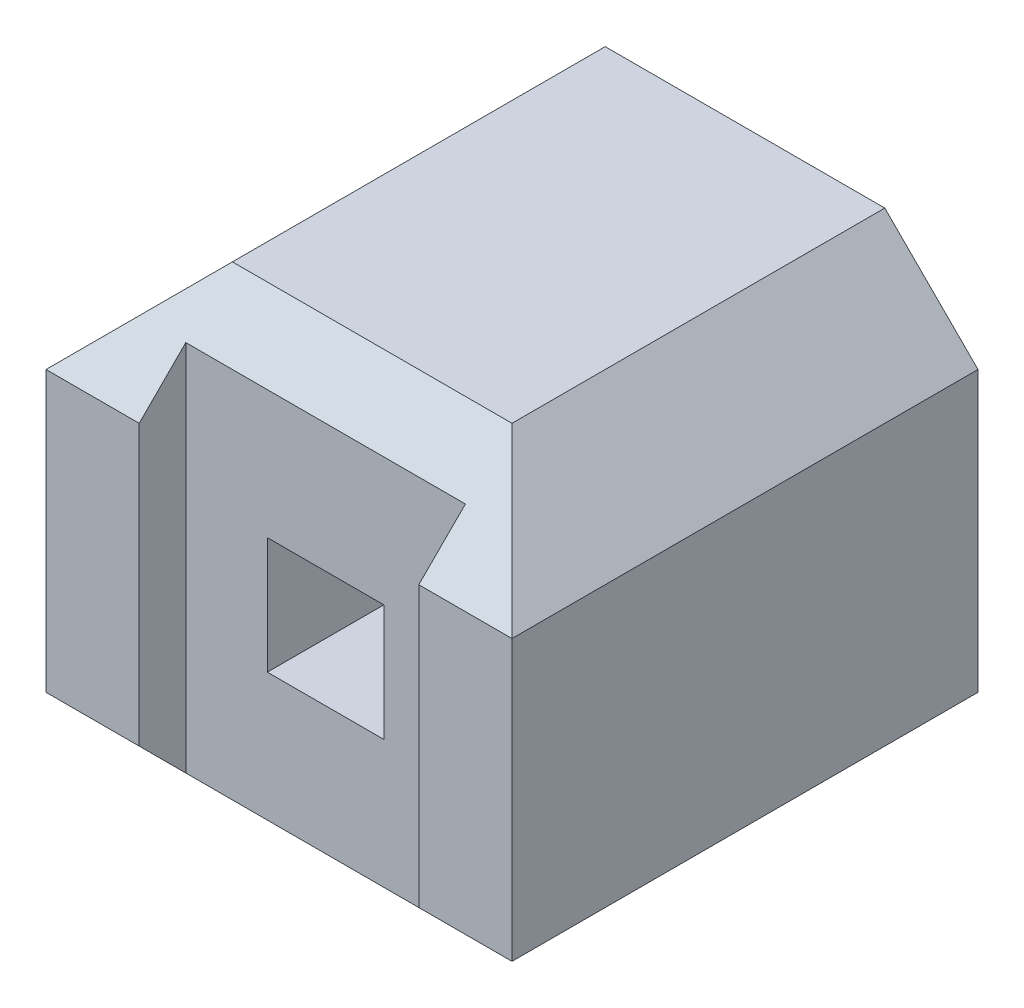
ISO-10303-21;
HEADER;
FILE_DESCRIPTION(('STEP AP214'),'2;1');
FILE_NAME('part.step','',(''),(''),'','','');
FILE_SCHEMA(('AUTOMOTIVE_DESIGN { 1 0 10303 214 1 1 1 1 }'));
ENDSEC;
DATA;
#1=APPLICATION_CONTEXT('core data for automotive mechanical design processes');
#2=APPLICATION_PROTOCOL_DEFINITION('international standard','automotive_design',2000,#1);
#3=PRODUCT_CONTEXT('',#1,'mechanical');
#4=PRODUCT('Part','Part','',(#3));
#5=PRODUCT_RELATED_PRODUCT_CATEGORY('part','',(#4));
#6=PRODUCT_DEFINITION_FORMATION('','',#4);
#7=PRODUCT_DEFINITION_CONTEXT('part definition',#1,'design');
#8=PRODUCT_DEFINITION('design','',#6,#7);
#9=PRODUCT_DEFINITION_SHAPE('','',#8);
#10=(LENGTH_UNIT() NAMED_UNIT(*) SI_UNIT(.MILLI.,.METRE.));
#11=(NAMED_UNIT(*) PLANE_ANGLE_UNIT() SI_UNIT($,.RADIAN.));
#12=(NAMED_UNIT(*) SI_UNIT($,.STERADIAN.) SOLID_ANGLE_UNIT());
#13=UNCERTAINTY_MEASURE_WITH_UNIT(LENGTH_MEASURE(1.E-05),#10,'distance_accuracy_value','');
#14=(GEOMETRIC_REPRESENTATION_CONTEXT(3) GLOBAL_UNCERTAINTY_ASSIGNED_CONTEXT((#13)) GLOBAL_UNIT_ASSIGNED_CONTEXT((#10,
#11,#12)) REPRESENTATION_CONTEXT('',''));
#15=CARTESIAN_POINT('',(0.,0.,0.));
#16=DIRECTION('',(0.,0.,1.));
#17=DIRECTION('',(1.,0.,0.));
#18=AXIS2_PLACEMENT_3D('',#15,#16,#17);
#19=CARTESIAN_POINT('',(1.27,11.43,2.54));
#20=DIRECTION('',(-1.,0.,0.));
#21=DIRECTION('',(0.,0.,1.));
#22=AXIS2_PLACEMENT_3D('',#19,#20,#21);
#23=PLANE('',#22);
#24=DIRECTION('',(0.,0.,1.));
#25=VECTOR('',#24,1.);
#26=CARTESIAN_POINT('',(1.27,13.462,2.54));
#27=LINE('',#26,#25);
#28=CARTESIAN_POINT('',(1.27,13.462,0.));
#29=VERTEX_POINT('',#28);
#30=CARTESIAN_POINT('',(1.27,13.462,2.54));
#31=VERTEX_POINT('',#30);
#32=EDGE_CURVE('E158',#29,#31,#27,.T.);
#33=ORIENTED_EDGE('',*,*,#32,.T.);
#34=DIRECTION('',(0.,1.,0.));
#35=VECTOR('',#34,1.);
#36=CARTESIAN_POINT('',(1.27,0.,2.54));
#37=LINE('',#36,#35);
#38=CARTESIAN_POINT('',(1.27,11.938,2.54));
#39=VERTEX_POINT('',#38);
#40=EDGE_CURVE('E127',#39,#31,#37,.T.);
#41=ORIENTED_EDGE('',*,*,#40,.F.);
#42=DIRECTION('',(0.,0.,1.));
#43=VECTOR('',#42,1.);
#44=CARTESIAN_POINT('',(1.27,11.938,2.54));
#45=LINE('',#44,#43);
#46=CARTESIAN_POINT('',(1.27,11.938,0.));
#47=VERTEX_POINT('',#46);
#48=EDGE_CURVE('E151',#39,#47,#45,.F.);
#49=ORIENTED_EDGE('',*,*,#48,.T.);
#50=DIRECTION('',(0.,1.,0.));
#51=VECTOR('',#50,1.);
#52=CARTESIAN_POINT('',(1.27,11.43,0.));
#53=LINE('',#52,#51);
#54=EDGE_CURVE('E19',#29,#47,#53,.F.);
#55=ORIENTED_EDGE('',*,*,#54,.F.);
#56=EDGE_LOOP('',(#33,#41,#49,#55));
#57=FACE_BOUND('',#56,.T.);
#58=ADVANCED_FACE('F16',(#57),#23,.F.);
#59=CARTESIAN_POINT('',(0.,0.,2.54));
#60=DIRECTION('',(0.,0.,1.));
#61=DIRECTION('',(1.,0.,0.));
#62=AXIS2_PLACEMENT_3D('',#59,#60,#61);
#63=PLANE('',#62);
#64=ORIENTED_EDGE('',*,*,#40,.T.);
#65=DIRECTION('',(1.,0.,0.));
#66=VECTOR('',#65,1.);
#67=CARTESIAN_POINT('',(0.,13.462,2.54));
#68=LINE('',#67,#66);
#69=CARTESIAN_POINT('',(0.762,13.462,2.54));
#70=VERTEX_POINT('',#69);
#71=EDGE_CURVE('E155',#31,#70,#68,.F.);
#72=ORIENTED_EDGE('',*,*,#71,.T.);
#73=DIRECTION('',(0.,-1.,0.));
#74=VECTOR('',#73,1.);
#75=CARTESIAN_POINT('',(0.762,13.97,2.54));
#76=LINE('',#75,#74);
#77=CARTESIAN_POINT('',(0.762,11.938,2.54));
#78=VERTEX_POINT('',#77);
#79=EDGE_CURVE('E134',#78,#70,#76,.F.);
#80=ORIENTED_EDGE('',*,*,#79,.F.);
#81=DIRECTION('',(1.,0.,0.));
#82=VECTOR('',#81,1.);
#83=CARTESIAN_POINT('',(0.,11.938,2.54));
#84=LINE('',#83,#82);
#85=EDGE_CURVE('E130',#78,#39,#84,.T.);
#86=ORIENTED_EDGE('',*,*,#85,.T.);
#87=EDGE_LOOP('',(#64,#72,#80,#86));
#88=FACE_BOUND('',#87,.T.);
#89=ADVANCED_FACE('F132',(#88),#63,.T.);
#90=CARTESIAN_POINT('',(1.27,11.938,2.54));
#91=DIRECTION('',(-0.707106781186548,0.707106781186548,0.));
#92=DIRECTION('',(-0.707106781186548,-0.707106781186548,0.));
#93=AXIS2_PLACEMENT_3D('',#90,#91,#92);
#94=PLANE('',#93);
#95=ORIENTED_EDGE('',*,*,#48,.F.);
#96=DIRECTION('',(0.577350269189626,0.577350269189625,0.577350269189626));
#97=VECTOR('',#96,1.);
#98=CARTESIAN_POINT('',(0.762,11.43,2.032));
#99=LINE('',#98,#97);
#100=CARTESIAN_POINT('',(0.762,11.43,2.032));
#101=VERTEX_POINT('',#100);
#102=EDGE_CURVE('E138',#101,#39,#99,.T.);
#103=ORIENTED_EDGE('',*,*,#102,.F.);
#104=DIRECTION('',(0.,0.,1.));
#105=VECTOR('',#104,1.);
#106=CARTESIAN_POINT('',(0.762,11.43,2.54));
#107=LINE('',#106,#105);
#108=CARTESIAN_POINT('',(0.761999999999999,11.43,0.));
#109=VERTEX_POINT('',#108);
#110=EDGE_CURVE('E182',#101,#109,#107,.F.);
#111=ORIENTED_EDGE('',*,*,#110,.T.);
#112=DIRECTION('',(-0.707106781186548,-0.707106781186548,0.));
#113=VECTOR('',#112,1.);
#114=CARTESIAN_POINT('',(1.27,11.938,0.));
#115=LINE('',#114,#113);
#116=EDGE_CURVE('E153',#47,#109,#115,.T.);
#117=ORIENTED_EDGE('',*,*,#116,.F.);
#118=EDGE_LOOP('',(#95,#103,#111,#117));
#119=FACE_BOUND('',#118,.T.);
#120=ADVANCED_FACE('F152',(#119),#94,.F.);
#121=CARTESIAN_POINT('',(0.762,13.97,2.54));
#122=DIRECTION('',(-0.707106781186547,-0.707106781186548,0.));
#123=DIRECTION('',(0.707106781186548,-0.707106781186547,0.));
#124=AXIS2_PLACEMENT_3D('',#121,#122,#123);
#125=PLANE('',#124);
#126=DIRECTION('',(0.,0.,-1.));
#127=VECTOR('',#126,1.);
#128=CARTESIAN_POINT('',(0.762,13.97,2.54));
#129=LINE('',#128,#127);
#130=CARTESIAN_POINT('',(0.762,13.97,0.));
#131=VERTEX_POINT('',#130);
#132=CARTESIAN_POINT('',(0.762,13.97,2.032));
#133=VERTEX_POINT('',#132);
#134=EDGE_CURVE('E186',#131,#133,#129,.F.);
#135=ORIENTED_EDGE('',*,*,#134,.T.);
#136=DIRECTION('',(-0.577350269189626,0.577350269189625,-0.577350269189626));
#137=VECTOR('',#136,1.);
#138=CARTESIAN_POINT('',(1.27,13.462,2.54));
#139=LINE('',#138,#137);
#140=EDGE_CURVE('E165',#31,#133,#139,.T.);
#141=ORIENTED_EDGE('',*,*,#140,.F.);
#142=ORIENTED_EDGE('',*,*,#32,.F.);
#143=DIRECTION('',(0.707106781186548,-0.707106781186547,0.));
#144=VECTOR('',#143,1.);
#145=CARTESIAN_POINT('',(0.762,13.97,0.));
#146=LINE('',#145,#144);
#147=EDGE_CURVE('E167',#131,#29,#146,.T.);
#148=ORIENTED_EDGE('',*,*,#147,.F.);
#149=EDGE_LOOP('',(#135,#141,#142,#148));
#150=FACE_BOUND('',#149,.T.);
#151=ADVANCED_FACE('F357',(#150),#125,.F.);
#152=CARTESIAN_POINT('',(0.762,13.97,2.286));
#153=DIRECTION('',(-1.,0.,0.));
#154=DIRECTION('',(0.,-1.,0.));
#155=AXIS2_PLACEMENT_3D('',#152,#153,#154);
#156=PLANE('',#155);
#157=ORIENTED_EDGE('',*,*,#79,.T.);
#158=DIRECTION('',(0.,-0.707106781186547,0.707106781186548));
#159=VECTOR('',#158,1.);
#160=CARTESIAN_POINT('',(0.762,13.462,2.54));
#161=LINE('',#160,#159);
#162=CARTESIAN_POINT('',(0.762,13.716,2.286));
#163=VERTEX_POINT('',#162);
#164=EDGE_CURVE('E196',#163,#70,#161,.T.);
#165=ORIENTED_EDGE('',*,*,#164,.F.);
#166=DIRECTION('',(0.,1.,0.));
#167=VECTOR('',#166,1.);
#168=CARTESIAN_POINT('',(0.762,0.,2.286));
#169=LINE('',#168,#167);
#170=CARTESIAN_POINT('',(0.762,11.684,2.286));
#171=VERTEX_POINT('',#170);
#172=EDGE_CURVE('E211',#163,#171,#169,.F.);
#173=ORIENTED_EDGE('',*,*,#172,.T.);
#174=DIRECTION('',(0.,-0.707106781186547,-0.707106781186548));
#175=VECTOR('',#174,1.);
#176=CARTESIAN_POINT('',(0.762,11.938,2.54));
#177=LINE('',#176,#175);
#178=EDGE_CURVE('E146',#78,#171,#177,.T.);
#179=ORIENTED_EDGE('',*,*,#178,.F.);
#180=EDGE_LOOP('',(#157,#165,#173,#179));
#181=FACE_BOUND('',#180,.T.);
#182=ADVANCED_FACE('F292',(#181),#156,.T.);
#183=CARTESIAN_POINT('',(-0.762,11.43,2.286));
#184=DIRECTION('',(1.,0.,0.));
#185=DIRECTION('',(0.,0.,-1.));
#186=AXIS2_PLACEMENT_3D('',#183,#184,#185);
#187=PLANE('',#186);
#188=DIRECTION('',(0.,1.,0.));
#189=VECTOR('',#188,1.);
#190=CARTESIAN_POINT('',(-0.762,0.,2.286));
#191=LINE('',#190,#189);
#192=CARTESIAN_POINT('',(-0.762,11.684,2.286));
#193=VERTEX_POINT('',#192);
#194=CARTESIAN_POINT('',(-0.762,13.716,2.286));
#195=VERTEX_POINT('',#194);
#196=EDGE_CURVE('E217',#193,#195,#191,.T.);
#197=ORIENTED_EDGE('',*,*,#196,.T.);
#198=DIRECTION('',(0.,-0.707106781186547,0.707106781186548));
#199=VECTOR('',#198,1.);
#200=CARTESIAN_POINT('',(-0.762,13.462,2.54));
#201=LINE('',#200,#199);
#202=CARTESIAN_POINT('',(-0.762,13.462,2.54));
#203=VERTEX_POINT('',#202);
#204=EDGE_CURVE('E194',#203,#195,#201,.F.);
#205=ORIENTED_EDGE('',*,*,#204,.F.);
#206=DIRECTION('',(0.,1.,0.));
#207=VECTOR('',#206,1.);
#208=CARTESIAN_POINT('',(-0.762,11.43,2.54));
#209=LINE('',#208,#207);
#210=CARTESIAN_POINT('',(-0.762,11.938,2.54));
#211=VERTEX_POINT('',#210);
#212=EDGE_CURVE('E171',#203,#211,#209,.F.);
#213=ORIENTED_EDGE('',*,*,#212,.T.);
#214=DIRECTION('',(0.,-0.707106781186547,-0.707106781186548));
#215=VECTOR('',#214,1.);
#216=CARTESIAN_POINT('',(-0.762,11.938,2.54));
#217=LINE('',#216,#215);
#218=EDGE_CURVE('E176',#193,#211,#217,.F.);
#219=ORIENTED_EDGE('',*,*,#218,.F.);
#220=EDGE_LOOP('',(#197,#205,#213,#219));
#221=FACE_BOUND('',#220,.T.);
#222=ADVANCED_FACE('F283',(#221),#187,.T.);
#223=CARTESIAN_POINT('',(0.3175,12.3825,2.794));
#224=DIRECTION('',(0.,-1.,0.));
#225=DIRECTION('',(0.,0.,-1.));
#226=AXIS2_PLACEMENT_3D('',#223,#224,#225);
#227=PLANE('',#226);
#228=DIRECTION('',(-1.,0.,0.));
#229=VECTOR('',#228,1.);
#230=CARTESIAN_POINT('',(0.,12.3825,2.286));
#231=LINE('',#230,#229);
#232=CARTESIAN_POINT('',(-0.3175,12.3825,2.286));
#233=VERTEX_POINT('',#232);
#234=CARTESIAN_POINT('',(0.3175,12.3825,2.286));
#235=VERTEX_POINT('',#234);
#236=EDGE_CURVE('E209',#233,#235,#231,.F.);
#237=ORIENTED_EDGE('',*,*,#236,.T.);
#238=DIRECTION('',(0.,0.,-1.));
#239=VECTOR('',#238,1.);
#240=CARTESIAN_POINT('',(0.3175,12.3825,2.794));
#241=LINE('',#240,#239);
#242=CARTESIAN_POINT('',(0.3175,12.3825,0.));
#243=VERTEX_POINT('',#242);
#244=EDGE_CURVE('E228',#235,#243,#241,.T.);
#245=ORIENTED_EDGE('',*,*,#244,.T.);
#246=DIRECTION('',(1.,0.,0.));
#247=VECTOR('',#246,1.);
#248=CARTESIAN_POINT('',(0.3175,12.3825,0.));
#249=LINE('',#248,#247);
#250=CARTESIAN_POINT('',(-0.3175,12.3825,0.));
#251=VERTEX_POINT('',#250);
#252=EDGE_CURVE('E173',#251,#243,#249,.T.);
#253=ORIENTED_EDGE('',*,*,#252,.F.);
#254=DIRECTION('',(0.,0.,1.));
#255=VECTOR('',#254,1.);
#256=CARTESIAN_POINT('',(-0.3175,12.3825,2.794));
#257=LINE('',#256,#255);
#258=EDGE_CURVE('E204',#251,#233,#257,.T.);
#259=ORIENTED_EDGE('',*,*,#258,.T.);
#260=EDGE_LOOP('',(#237,#245,#253,#259));
#261=FACE_BOUND('',#260,.T.);
#262=ADVANCED_FACE('F281',(#261),#227,.F.);
#263=CARTESIAN_POINT('',(0.,11.938,2.54));
#264=DIRECTION('',(0.,-0.707106781186548,0.707106781186547));
#265=DIRECTION('',(0.,-0.707106781186547,-0.707106781186548));
#266=AXIS2_PLACEMENT_3D('',#263,#264,#265);
#267=PLANE('',#266);
#268=ORIENTED_EDGE('',*,*,#85,.F.);
#269=ORIENTED_EDGE('',*,*,#178,.T.);
#270=DIRECTION('',(-1.,0.,0.));
#271=VECTOR('',#270,1.);
#272=CARTESIAN_POINT('',(0.,11.684,2.286));
#273=LINE('',#272,#271);
#274=EDGE_CURVE('E214',#171,#193,#273,.T.);
#275=ORIENTED_EDGE('',*,*,#274,.T.);
#276=ORIENTED_EDGE('',*,*,#218,.T.);
#277=DIRECTION('',(1.,0.,0.));
#278=VECTOR('',#277,1.);
#279=CARTESIAN_POINT('',(0.,11.938,2.54));
#280=LINE('',#279,#278);
#281=CARTESIAN_POINT('',(-1.27,11.938,2.54));
#282=VERTEX_POINT('',#281);
#283=EDGE_CURVE('E147',#211,#282,#280,.F.);
#284=ORIENTED_EDGE('',*,*,#283,.T.);
#285=DIRECTION('',(0.577350269189626,-0.577350269189625,-0.577350269189626));
#286=VECTOR('',#285,1.);
#287=CARTESIAN_POINT('',(-1.27,11.938,2.54));
#288=LINE('',#287,#286);
#289=CARTESIAN_POINT('',(-0.762,11.43,2.032));
#290=VERTEX_POINT('',#289);
#291=EDGE_CURVE('E231',#282,#290,#288,.T.);
#292=ORIENTED_EDGE('',*,*,#291,.T.);
#293=DIRECTION('',(1.,0.,0.));
#294=VECTOR('',#293,1.);
#295=CARTESIAN_POINT('',(-1.27,11.43,2.032));
#296=LINE('',#295,#294);
#297=EDGE_CURVE('E142',#290,#101,#296,.T.);
#298=ORIENTED_EDGE('',*,*,#297,.T.);
#299=ORIENTED_EDGE('',*,*,#102,.T.);
#300=EDGE_LOOP('',(#268,#269,#275,#276,#284,#292,#298,#299));
#301=FACE_BOUND('',#300,.T.);
#302=ADVANCED_FACE('F140',(#301),#267,.T.);
#303=CARTESIAN_POINT('',(-1.27,11.43,2.54));
#304=DIRECTION('',(0.,1.,0.));
#305=DIRECTION('',(0.,0.,1.));
#306=AXIS2_PLACEMENT_3D('',#303,#304,#305);
#307=PLANE('',#306);
#308=ORIENTED_EDGE('',*,*,#110,.F.);
#309=ORIENTED_EDGE('',*,*,#297,.F.);
#310=DIRECTION('',(0.,0.,1.));
#311=VECTOR('',#310,1.);
#312=CARTESIAN_POINT('',(-0.762,11.43,2.54));
#313=LINE('',#312,#311);
#314=CARTESIAN_POINT('',(-0.762,11.43,0.));
#315=VERTEX_POINT('',#314);
#316=EDGE_CURVE('E233',#290,#315,#313,.F.);
#317=ORIENTED_EDGE('',*,*,#316,.T.);
#318=DIRECTION('',(1.,0.,0.));
#319=VECTOR('',#318,1.);
#320=CARTESIAN_POINT('',(-1.27,11.43,0.));
#321=LINE('',#320,#319);
#322=EDGE_CURVE('E184',#109,#315,#321,.F.);
#323=ORIENTED_EDGE('',*,*,#322,.F.);
#324=EDGE_LOOP('',(#308,#309,#317,#323));
#325=FACE_BOUND('',#324,.T.);
#326=ADVANCED_FACE('F290',(#325),#307,.F.);
#327=CARTESIAN_POINT('',(1.27,13.97,2.54));
#328=DIRECTION('',(0.,-1.,0.));
#329=DIRECTION('',(0.,0.,-1.));
#330=AXIS2_PLACEMENT_3D('',#327,#328,#329);
#331=PLANE('',#330);
#332=DIRECTION('',(0.,0.,1.));
#333=VECTOR('',#332,1.);
#334=CARTESIAN_POINT('',(-0.761999999999999,13.97,2.54));
#335=LINE('',#334,#333);
#336=CARTESIAN_POINT('',(-0.762,13.97,0.));
#337=VERTEX_POINT('',#336);
#338=CARTESIAN_POINT('',(-0.762,13.97,2.032));
#339=VERTEX_POINT('',#338);
#340=EDGE_CURVE('E238',#337,#339,#335,.T.);
#341=ORIENTED_EDGE('',*,*,#340,.T.);
#342=DIRECTION('',(1.,0.,0.));
#343=VECTOR('',#342,1.);
#344=CARTESIAN_POINT('',(0.,13.97,2.032));
#345=LINE('',#344,#343);
#346=EDGE_CURVE('E199',#133,#339,#345,.F.);
#347=ORIENTED_EDGE('',*,*,#346,.F.);
#348=ORIENTED_EDGE('',*,*,#134,.F.);
#349=DIRECTION('',(1.,0.,0.));
#350=VECTOR('',#349,1.);
#351=CARTESIAN_POINT('',(1.27,13.97,0.));
#352=LINE('',#351,#350);
#353=EDGE_CURVE('E189',#337,#131,#352,.T.);
#354=ORIENTED_EDGE('',*,*,#353,.F.);
#355=EDGE_LOOP('',(#341,#347,#348,#354));
#356=FACE_BOUND('',#355,.T.);
#357=ADVANCED_FACE('F328',(#356),#331,.F.);
#358=CARTESIAN_POINT('',(0.,13.462,2.54));
#359=DIRECTION('',(0.,0.707106781186548,0.707106781186547));
#360=DIRECTION('',(0.,-0.707106781186547,0.707106781186548));
#361=AXIS2_PLACEMENT_3D('',#358,#359,#360);
#362=PLANE('',#361);
#363=ORIENTED_EDGE('',*,*,#346,.T.);
#364=DIRECTION('',(-0.577350269189626,-0.577350269189626,0.577350269189625));
#365=VECTOR('',#364,1.);
#366=CARTESIAN_POINT('',(-0.761999999999999,13.97,2.032));
#367=LINE('',#366,#365);
#368=CARTESIAN_POINT('',(-1.27,13.462,2.54));
#369=VERTEX_POINT('',#368);
#370=EDGE_CURVE('E241',#339,#369,#367,.T.);
#371=ORIENTED_EDGE('',*,*,#370,.T.);
#372=DIRECTION('',(1.,0.,0.));
#373=VECTOR('',#372,1.);
#374=CARTESIAN_POINT('',(0.,13.462,2.54));
#375=LINE('',#374,#373);
#376=EDGE_CURVE('E192',#369,#203,#375,.T.);
#377=ORIENTED_EDGE('',*,*,#376,.T.);
#378=ORIENTED_EDGE('',*,*,#204,.T.);
#379=DIRECTION('',(-1.,0.,0.));
#380=VECTOR('',#379,1.);
#381=CARTESIAN_POINT('',(0.,13.716,2.286));
#382=LINE('',#381,#380);
#383=EDGE_CURVE('E220',#195,#163,#382,.F.);
#384=ORIENTED_EDGE('',*,*,#383,.T.);
#385=ORIENTED_EDGE('',*,*,#164,.T.);
#386=ORIENTED_EDGE('',*,*,#71,.F.);
#387=ORIENTED_EDGE('',*,*,#140,.T.);
#388=EDGE_LOOP('',(#363,#371,#377,#378,#384,#385,#386,#387));
#389=FACE_BOUND('',#388,.T.);
#390=ADVANCED_FACE('F325',(#389),#362,.T.);
#391=CARTESIAN_POINT('',(-0.3175,12.3825,2.794));
#392=DIRECTION('',(-1.,0.,0.));
#393=DIRECTION('',(0.,0.,1.));
#394=AXIS2_PLACEMENT_3D('',#391,#392,#393);
#395=PLANE('',#394);
#396=DIRECTION('',(0.,1.,0.));
#397=VECTOR('',#396,1.);
#398=CARTESIAN_POINT('',(-0.3175,0.,2.286));
#399=LINE('',#398,#397);
#400=CARTESIAN_POINT('',(-0.3175,13.0175,2.286));
#401=VERTEX_POINT('',#400);
#402=EDGE_CURVE('E206',#401,#233,#399,.F.);
#403=ORIENTED_EDGE('',*,*,#402,.T.);
#404=ORIENTED_EDGE('',*,*,#258,.F.);
#405=DIRECTION('',(0.,1.,0.));
#406=VECTOR('',#405,1.);
#407=CARTESIAN_POINT('',(-0.3175,12.3825,0.));
#408=LINE('',#407,#406);
#409=CARTESIAN_POINT('',(-0.3175,13.0175,0.));
#410=VERTEX_POINT('',#409);
#411=EDGE_CURVE('E201',#410,#251,#408,.F.);
#412=ORIENTED_EDGE('',*,*,#411,.F.);
#413=DIRECTION('',(0.,0.,1.));
#414=VECTOR('',#413,1.);
#415=CARTESIAN_POINT('',(-0.3175,13.0175,2.794));
#416=LINE('',#415,#414);
#417=EDGE_CURVE('E245',#410,#401,#416,.T.);
#418=ORIENTED_EDGE('',*,*,#417,.T.);
#419=EDGE_LOOP('',(#403,#404,#412,#418));
#420=FACE_BOUND('',#419,.T.);
#421=ADVANCED_FACE('F278',(#420),#395,.F.);
#422=CARTESIAN_POINT('',(0.,0.,2.286));
#423=DIRECTION('',(0.,0.,-1.));
#424=DIRECTION('',(-1.,0.,0.));
#425=AXIS2_PLACEMENT_3D('',#422,#423,#424);
#426=PLANE('',#425);
#427=ORIENTED_EDGE('',*,*,#196,.F.);
#428=ORIENTED_EDGE('',*,*,#274,.F.);
#429=ORIENTED_EDGE('',*,*,#172,.F.);
#430=ORIENTED_EDGE('',*,*,#383,.F.);
#431=EDGE_LOOP('',(#427,#428,#429,#430));
#432=FACE_BOUND('',#431,.T.);
#433=ORIENTED_EDGE('',*,*,#402,.F.);
#434=DIRECTION('',(1.,0.,0.));
#435=VECTOR('',#434,1.);
#436=CARTESIAN_POINT('',(-0.3175,13.0175,2.286));
#437=LINE('',#436,#435);
#438=CARTESIAN_POINT('',(0.3175,13.0175,2.286));
#439=VERTEX_POINT('',#438);
#440=EDGE_CURVE('E248',#401,#439,#437,.T.);
#441=ORIENTED_EDGE('',*,*,#440,.T.);
#442=DIRECTION('',(0.,1.,0.));
#443=VECTOR('',#442,1.);
#444=CARTESIAN_POINT('',(0.3175,13.0175,2.286));
#445=LINE('',#444,#443);
#446=EDGE_CURVE('E225',#439,#235,#445,.F.);
#447=ORIENTED_EDGE('',*,*,#446,.T.);
#448=ORIENTED_EDGE('',*,*,#236,.F.);
#449=EDGE_LOOP('',(#433,#441,#447,#448));
#450=FACE_BOUND('',#449,.T.);
#451=ADVANCED_FACE('F276',(#432,#450),#426,.F.);
#452=CARTESIAN_POINT('',(0.3175,13.0175,2.794));
#453=DIRECTION('',(1.,0.,0.));
#454=DIRECTION('',(0.,0.,-1.));
#455=AXIS2_PLACEMENT_3D('',#452,#453,#454);
#456=PLANE('',#455);
#457=ORIENTED_EDGE('',*,*,#446,.F.);
#458=DIRECTION('',(0.,0.,1.));
#459=VECTOR('',#458,1.);
#460=CARTESIAN_POINT('',(0.3175,13.0175,2.794));
#461=LINE('',#460,#459);
#462=CARTESIAN_POINT('',(0.3175,13.0175,0.));
#463=VERTEX_POINT('',#462);
#464=EDGE_CURVE('E251',#439,#463,#461,.F.);
#465=ORIENTED_EDGE('',*,*,#464,.T.);
#466=DIRECTION('',(0.,1.,0.));
#467=VECTOR('',#466,1.);
#468=CARTESIAN_POINT('',(0.3175,13.0175,0.));
#469=LINE('',#468,#467);
#470=EDGE_CURVE('E223',#243,#463,#469,.T.);
#471=ORIENTED_EDGE('',*,*,#470,.F.);
#472=ORIENTED_EDGE('',*,*,#244,.F.);
#473=EDGE_LOOP('',(#457,#465,#471,#472));
#474=FACE_BOUND('',#473,.T.);
#475=ADVANCED_FACE('F273',(#474),#456,.F.);
#476=CARTESIAN_POINT('',(-0.762,11.43,2.54));
#477=DIRECTION('',(0.707106781186547,0.707106781186548,0.));
#478=DIRECTION('',(-0.707106781186548,0.707106781186547,0.));
#479=AXIS2_PLACEMENT_3D('',#476,#477,#478);
#480=PLANE('',#479);
#481=ORIENTED_EDGE('',*,*,#316,.F.);
#482=ORIENTED_EDGE('',*,*,#291,.F.);
#483=DIRECTION('',(0.,0.,-1.));
#484=VECTOR('',#483,1.);
#485=CARTESIAN_POINT('',(-1.27,11.938,2.54));
#486=LINE('',#485,#484);
#487=CARTESIAN_POINT('',(-1.27,11.938,0.));
#488=VERTEX_POINT('',#487);
#489=EDGE_CURVE('E254',#282,#488,#486,.T.);
#490=ORIENTED_EDGE('',*,*,#489,.T.);
#491=DIRECTION('',(-0.707106781186548,0.707106781186547,0.));
#492=VECTOR('',#491,1.);
#493=CARTESIAN_POINT('',(-0.762,11.43,0.));
#494=LINE('',#493,#492);
#495=EDGE_CURVE('E236',#315,#488,#494,.T.);
#496=ORIENTED_EDGE('',*,*,#495,.F.);
#497=EDGE_LOOP('',(#481,#482,#490,#496));
#498=FACE_BOUND('',#497,.T.);
#499=ADVANCED_FACE('F314',(#498),#480,.F.);
#500=CARTESIAN_POINT('',(-1.27,13.462,2.54));
#501=DIRECTION('',(0.707106781186548,-0.707106781186548,0.));
#502=DIRECTION('',(0.707106781186548,0.707106781186548,0.));
#503=AXIS2_PLACEMENT_3D('',#500,#501,#502);
#504=PLANE('',#503);
#505=DIRECTION('',(0.,0.,-1.));
#506=VECTOR('',#505,1.);
#507=CARTESIAN_POINT('',(-1.27,13.462,2.54));
#508=LINE('',#507,#506);
#509=CARTESIAN_POINT('',(-1.27,13.462,0.));
#510=VERTEX_POINT('',#509);
#511=EDGE_CURVE('E257',#510,#369,#508,.F.);
#512=ORIENTED_EDGE('',*,*,#511,.T.);
#513=ORIENTED_EDGE('',*,*,#370,.F.);
#514=ORIENTED_EDGE('',*,*,#340,.F.);
#515=DIRECTION('',(0.707106781186548,0.707106781186548,0.));
#516=VECTOR('',#515,1.);
#517=CARTESIAN_POINT('',(-1.27,13.462,0.));
#518=LINE('',#517,#516);
#519=EDGE_CURVE('E34',#510,#337,#518,.T.);
#520=ORIENTED_EDGE('',*,*,#519,.F.);
#521=EDGE_LOOP('',(#512,#513,#514,#520));
#522=FACE_BOUND('',#521,.T.);
#523=ADVANCED_FACE('F310',(#522),#504,.F.);
#524=CARTESIAN_POINT('',(0.,0.,2.54));
#525=DIRECTION('',(0.,0.,1.));
#526=DIRECTION('',(1.,0.,0.));
#527=AXIS2_PLACEMENT_3D('',#524,#525,#526);
#528=PLANE('',#527);
#529=DIRECTION('',(0.,1.,0.));
#530=VECTOR('',#529,1.);
#531=CARTESIAN_POINT('',(-1.27,13.97,2.54));
#532=LINE('',#531,#530);
#533=EDGE_CURVE('E259',#369,#282,#532,.F.);
#534=ORIENTED_EDGE('',*,*,#533,.T.);
#535=ORIENTED_EDGE('',*,*,#283,.F.);
#536=ORIENTED_EDGE('',*,*,#212,.F.);
#537=ORIENTED_EDGE('',*,*,#376,.F.);
#538=EDGE_LOOP('',(#534,#535,#536,#537));
#539=FACE_BOUND('',#538,.T.);
#540=ADVANCED_FACE('F307',(#539),#528,.T.);
#541=CARTESIAN_POINT('',(-0.3175,13.0175,2.794));
#542=DIRECTION('',(0.,1.,0.));
#543=DIRECTION('',(0.,0.,1.));
#544=AXIS2_PLACEMENT_3D('',#541,#542,#543);
#545=PLANE('',#544);
#546=ORIENTED_EDGE('',*,*,#440,.F.);
#547=ORIENTED_EDGE('',*,*,#417,.F.);
#548=DIRECTION('',(1.,0.,0.));
#549=VECTOR('',#548,1.);
#550=CARTESIAN_POINT('',(0.,13.0175,0.));
#551=LINE('',#550,#549);
#552=EDGE_CURVE('E25',#410,#463,#551,.T.);
#553=ORIENTED_EDGE('',*,*,#552,.T.);
#554=ORIENTED_EDGE('',*,*,#464,.F.);
#555=EDGE_LOOP('',(#546,#547,#553,#554));
#556=FACE_BOUND('',#555,.T.);
#557=ADVANCED_FACE('F268',(#556),#545,.F.);
#558=CARTESIAN_POINT('',(-1.27,13.97,2.54));
#559=DIRECTION('',(1.,0.,0.));
#560=DIRECTION('',(0.,0.,-1.));
#561=AXIS2_PLACEMENT_3D('',#558,#559,#560);
#562=PLANE('',#561);
#563=ORIENTED_EDGE('',*,*,#511,.F.);
#564=DIRECTION('',(0.,1.,0.));
#565=VECTOR('',#564,1.);
#566=CARTESIAN_POINT('',(-1.27,0.,0.));
#567=LINE('',#566,#565);
#568=EDGE_CURVE('E11',#510,#488,#567,.F.);
#569=ORIENTED_EDGE('',*,*,#568,.T.);
#570=ORIENTED_EDGE('',*,*,#489,.F.);
#571=ORIENTED_EDGE('',*,*,#533,.F.);
#572=EDGE_LOOP('',(#563,#569,#570,#571));
#573=FACE_BOUND('',#572,.T.);
#574=ADVANCED_FACE('F296',(#573),#562,.F.);
#575=CARTESIAN_POINT('',(0.,0.,0.));
#576=DIRECTION('',(0.,0.,1.));
#577=DIRECTION('',(1.,0.,0.));
#578=AXIS2_PLACEMENT_3D('',#575,#576,#577);
#579=PLANE('',#578);
#580=ORIENTED_EDGE('',*,*,#519,.T.);
#581=ORIENTED_EDGE('',*,*,#353,.T.);
#582=ORIENTED_EDGE('',*,*,#147,.T.);
#583=ORIENTED_EDGE('',*,*,#54,.T.);
#584=ORIENTED_EDGE('',*,*,#116,.T.);
#585=ORIENTED_EDGE('',*,*,#322,.T.);
#586=ORIENTED_EDGE('',*,*,#495,.T.);
#587=ORIENTED_EDGE('',*,*,#568,.F.);
#588=EDGE_LOOP('',(#580,#581,#582,#583,#584,#585,#586,#587));
#589=FACE_BOUND('',#588,.T.);
#590=ORIENTED_EDGE('',*,*,#411,.T.);
#591=ORIENTED_EDGE('',*,*,#252,.T.);
#592=ORIENTED_EDGE('',*,*,#470,.T.);
#593=ORIENTED_EDGE('',*,*,#552,.F.);
#594=EDGE_LOOP('',(#590,#591,#592,#593));
#595=FACE_BOUND('',#594,.T.);
#596=ADVANCED_FACE('F270',(#589,#595),#579,.F.);
#597=CLOSED_SHELL('',(#58,#89,#120,#151,#182,#222,#262,#302,#326,#357,#390,#421,#451,#475,#499,
#523,#540,#557,#574,#596));
#598=MANIFOLD_SOLID_BREP('B1',#597);
#599=ADVANCED_BREP_SHAPE_REPRESENTATION('',(#18,#598),#14);
#600=SHAPE_DEFINITION_REPRESENTATION(#9,#599);
ENDSEC;
END-ISO-10303-21;
